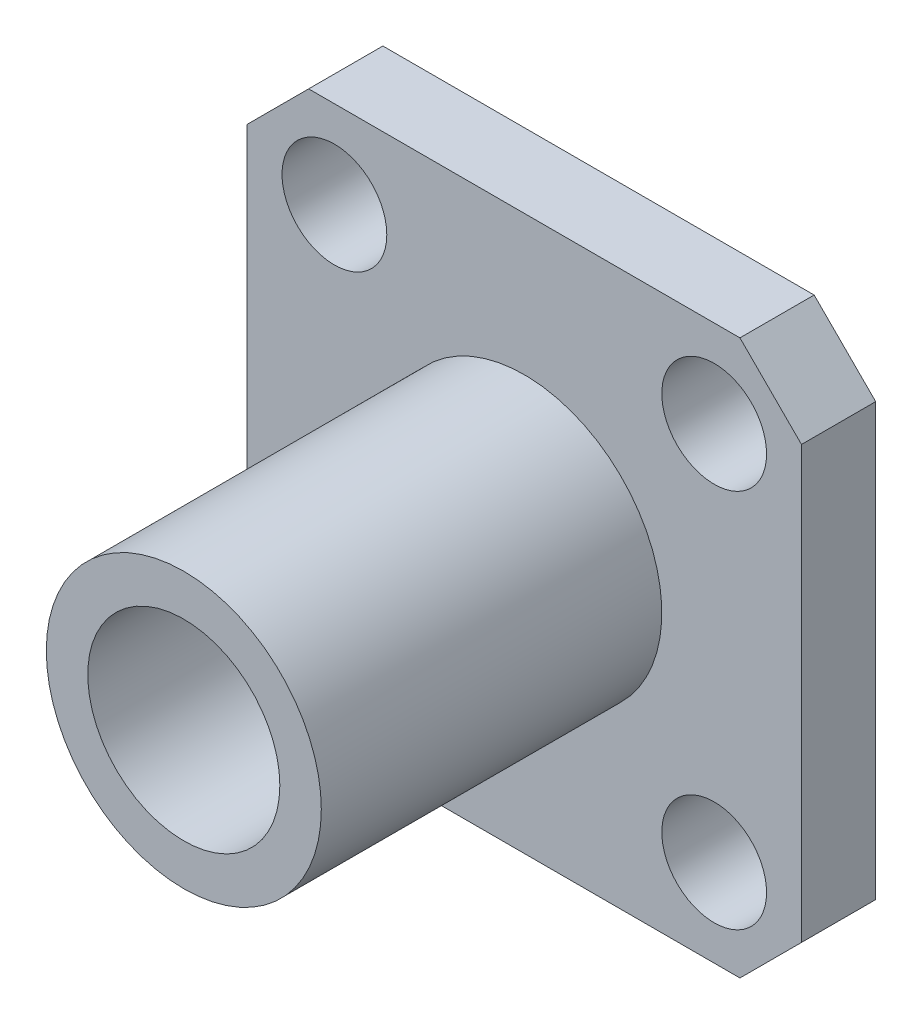
ISO-10303-21;
HEADER;
FILE_DESCRIPTION(('STEP AP214'),'2;1');
FILE_NAME('part.step','',(''),(''),'','','');
FILE_SCHEMA(('AUTOMOTIVE_DESIGN { 1 0 10303 214 1 1 1 1 }'));
ENDSEC;
DATA;
#1=APPLICATION_CONTEXT('core data for automotive mechanical design processes');
#2=APPLICATION_PROTOCOL_DEFINITION('international standard','automotive_design',2000,#1);
#3=PRODUCT_CONTEXT('',#1,'mechanical');
#4=PRODUCT('Part','Part','',(#3));
#5=PRODUCT_RELATED_PRODUCT_CATEGORY('part','',(#4));
#6=PRODUCT_DEFINITION_FORMATION('','',#4);
#7=PRODUCT_DEFINITION_CONTEXT('part definition',#1,'design');
#8=PRODUCT_DEFINITION('design','',#6,#7);
#9=PRODUCT_DEFINITION_SHAPE('','',#8);
#10=(LENGTH_UNIT() NAMED_UNIT(*) SI_UNIT(.MILLI.,.METRE.));
#11=(NAMED_UNIT(*) PLANE_ANGLE_UNIT() SI_UNIT($,.RADIAN.));
#12=(NAMED_UNIT(*) SI_UNIT($,.STERADIAN.) SOLID_ANGLE_UNIT());
#13=UNCERTAINTY_MEASURE_WITH_UNIT(LENGTH_MEASURE(1.E-05),#10,'distance_accuracy_value','');
#14=(GEOMETRIC_REPRESENTATION_CONTEXT(3) GLOBAL_UNCERTAINTY_ASSIGNED_CONTEXT((#13)) GLOBAL_UNIT_ASSIGNED_CONTEXT((#10,
#11,#12)) REPRESENTATION_CONTEXT('',''));
#15=CARTESIAN_POINT('',(0.,0.,0.));
#16=DIRECTION('',(0.,0.,1.));
#17=DIRECTION('',(1.,0.,0.));
#18=AXIS2_PLACEMENT_3D('',#15,#16,#17);
#19=CARTESIAN_POINT('',(6.35,6.35,1.7));
#20=DIRECTION('',(0.,-1.,0.));
#21=DIRECTION('',(0.,0.,-1.));
#22=AXIS2_PLACEMENT_3D('',#19,#20,#21);
#23=PLANE('',#22);
#24=DIRECTION('',(-1.,0.,0.));
#25=VECTOR('',#24,1.);
#26=CARTESIAN_POINT('',(6.35,6.35,0.));
#27=LINE('',#26,#25);
#28=CARTESIAN_POINT('',(4.94,6.35,0.));
#29=VERTEX_POINT('',#28);
#30=CARTESIAN_POINT('',(-4.93999999999999,6.35,0.));
#31=VERTEX_POINT('',#30);
#32=EDGE_CURVE('E164',#29,#31,#27,.T.);
#33=ORIENTED_EDGE('',*,*,#32,.T.);
#34=DIRECTION('',(0.,0.,1.));
#35=VECTOR('',#34,1.);
#36=CARTESIAN_POINT('',(-4.93999999999999,6.35,1.7));
#37=LINE('',#36,#35);
#38=CARTESIAN_POINT('',(-4.93999999999999,6.35,1.7));
#39=VERTEX_POINT('',#38);
#40=EDGE_CURVE('E139',#31,#39,#37,.T.);
#41=ORIENTED_EDGE('',*,*,#40,.T.);
#42=DIRECTION('',(-1.,0.,0.));
#43=VECTOR('',#42,1.);
#44=CARTESIAN_POINT('',(6.35,6.35,1.7));
#45=LINE('',#44,#43);
#46=CARTESIAN_POINT('',(4.94,6.35,1.7));
#47=VERTEX_POINT('',#46);
#48=EDGE_CURVE('E177',#47,#39,#45,.T.);
#49=ORIENTED_EDGE('',*,*,#48,.F.);
#50=DIRECTION('',(0.,0.,-1.));
#51=VECTOR('',#50,1.);
#52=CARTESIAN_POINT('',(4.94,6.35,1.7));
#53=LINE('',#52,#51);
#54=EDGE_CURVE('E145',#47,#29,#53,.T.);
#55=ORIENTED_EDGE('',*,*,#54,.T.);
#56=EDGE_LOOP('',(#33,#41,#49,#55));
#57=FACE_BOUND('',#56,.T.);
#58=ADVANCED_FACE('F65',(#57),#23,.F.);
#59=CARTESIAN_POINT('',(-6.35,-6.35,1.7));
#60=DIRECTION('',(1.,0.,0.));
#61=DIRECTION('',(0.,0.,-1.));
#62=AXIS2_PLACEMENT_3D('',#59,#60,#61);
#63=PLANE('',#62);
#64=DIRECTION('',(0.,-1.,0.));
#65=VECTOR('',#64,1.);
#66=CARTESIAN_POINT('',(-6.35,-6.35,1.7));
#67=LINE('',#66,#65);
#68=CARTESIAN_POINT('',(-6.35,4.93999999999999,1.7));
#69=VERTEX_POINT('',#68);
#70=CARTESIAN_POINT('',(-6.35,-4.94,1.7));
#71=VERTEX_POINT('',#70);
#72=EDGE_CURVE('E155',#69,#71,#67,.T.);
#73=ORIENTED_EDGE('',*,*,#72,.F.);
#74=DIRECTION('',(0.,0.,-1.));
#75=VECTOR('',#74,1.);
#76=CARTESIAN_POINT('',(-6.35,4.93999999999999,1.7));
#77=LINE('',#76,#75);
#78=CARTESIAN_POINT('',(-6.35,4.93999999999999,0.));
#79=VERTEX_POINT('',#78);
#80=EDGE_CURVE('E138',#69,#79,#77,.T.);
#81=ORIENTED_EDGE('',*,*,#80,.T.);
#82=DIRECTION('',(0.,-1.,0.));
#83=VECTOR('',#82,1.);
#84=CARTESIAN_POINT('',(-6.35,-6.35,0.));
#85=LINE('',#84,#83);
#86=CARTESIAN_POINT('',(-6.35,-4.94,0.));
#87=VERTEX_POINT('',#86);
#88=EDGE_CURVE('E152',#79,#87,#85,.T.);
#89=ORIENTED_EDGE('',*,*,#88,.T.);
#90=DIRECTION('',(0.,0.,1.));
#91=VECTOR('',#90,1.);
#92=CARTESIAN_POINT('',(-6.35,-4.94,1.7));
#93=LINE('',#92,#91);
#94=EDGE_CURVE('E158',#87,#71,#93,.T.);
#95=ORIENTED_EDGE('',*,*,#94,.T.);
#96=EDGE_LOOP('',(#73,#81,#89,#95));
#97=FACE_BOUND('',#96,.T.);
#98=ADVANCED_FACE('F151',(#97),#63,.F.);
#99=CARTESIAN_POINT('',(6.35,-6.35,1.7));
#100=DIRECTION('',(0.,1.,0.));
#101=DIRECTION('',(0.,0.,1.));
#102=AXIS2_PLACEMENT_3D('',#99,#100,#101);
#103=PLANE('',#102);
#104=DIRECTION('',(1.,0.,0.));
#105=VECTOR('',#104,1.);
#106=CARTESIAN_POINT('',(6.35,-6.35,0.));
#107=LINE('',#106,#105);
#108=CARTESIAN_POINT('',(-4.93999999999999,-6.35,0.));
#109=VERTEX_POINT('',#108);
#110=CARTESIAN_POINT('',(4.94,-6.35,0.));
#111=VERTEX_POINT('',#110);
#112=EDGE_CURVE('E163',#109,#111,#107,.T.);
#113=ORIENTED_EDGE('',*,*,#112,.T.);
#114=DIRECTION('',(0.,0.,1.));
#115=VECTOR('',#114,1.);
#116=CARTESIAN_POINT('',(4.94,-6.35,1.7));
#117=LINE('',#116,#115);
#118=CARTESIAN_POINT('',(4.94,-6.35,1.7));
#119=VERTEX_POINT('',#118);
#120=EDGE_CURVE('E75',#111,#119,#117,.T.);
#121=ORIENTED_EDGE('',*,*,#120,.T.);
#122=DIRECTION('',(1.,0.,0.));
#123=VECTOR('',#122,1.);
#124=CARTESIAN_POINT('',(6.35,-6.35,1.7));
#125=LINE('',#124,#123);
#126=CARTESIAN_POINT('',(-4.93999999999999,-6.35,1.7));
#127=VERTEX_POINT('',#126);
#128=EDGE_CURVE('E218',#127,#119,#125,.T.);
#129=ORIENTED_EDGE('',*,*,#128,.F.);
#130=DIRECTION('',(0.,0.,-1.));
#131=VECTOR('',#130,1.);
#132=CARTESIAN_POINT('',(-4.93999999999999,-6.35,1.7));
#133=LINE('',#132,#131);
#134=EDGE_CURVE('E210',#127,#109,#133,.T.);
#135=ORIENTED_EDGE('',*,*,#134,.T.);
#136=EDGE_LOOP('',(#113,#121,#129,#135));
#137=FACE_BOUND('',#136,.T.);
#138=ADVANCED_FACE('F217',(#137),#103,.F.);
#139=CARTESIAN_POINT('',(6.35,-6.35,1.7));
#140=DIRECTION('',(-1.,0.,0.));
#141=DIRECTION('',(0.,0.,1.));
#142=AXIS2_PLACEMENT_3D('',#139,#140,#141);
#143=PLANE('',#142);
#144=DIRECTION('',(0.,1.,0.));
#145=VECTOR('',#144,1.);
#146=CARTESIAN_POINT('',(6.35,-6.35,0.));
#147=LINE('',#146,#145);
#148=CARTESIAN_POINT('',(6.35,-4.94,0.));
#149=VERTEX_POINT('',#148);
#150=CARTESIAN_POINT('',(6.35,4.93999999999999,0.));
#151=VERTEX_POINT('',#150);
#152=EDGE_CURVE('E169',#149,#151,#147,.T.);
#153=ORIENTED_EDGE('',*,*,#152,.T.);
#154=DIRECTION('',(0.,0.,1.));
#155=VECTOR('',#154,1.);
#156=CARTESIAN_POINT('',(6.35,4.93999999999999,1.7));
#157=LINE('',#156,#155);
#158=CARTESIAN_POINT('',(6.35,4.93999999999999,1.7));
#159=VERTEX_POINT('',#158);
#160=EDGE_CURVE('E82',#151,#159,#157,.T.);
#161=ORIENTED_EDGE('',*,*,#160,.T.);
#162=DIRECTION('',(0.,1.,0.));
#163=VECTOR('',#162,1.);
#164=CARTESIAN_POINT('',(6.35,-6.35,1.7));
#165=LINE('',#164,#163);
#166=CARTESIAN_POINT('',(6.35,-4.94,1.7));
#167=VERTEX_POINT('',#166);
#168=EDGE_CURVE('E179',#167,#159,#165,.T.);
#169=ORIENTED_EDGE('',*,*,#168,.F.);
#170=DIRECTION('',(0.,0.,-1.));
#171=VECTOR('',#170,1.);
#172=CARTESIAN_POINT('',(6.35,-4.94,1.7));
#173=LINE('',#172,#171);
#174=EDGE_CURVE('E204',#167,#149,#173,.T.);
#175=ORIENTED_EDGE('',*,*,#174,.T.);
#176=EDGE_LOOP('',(#153,#161,#169,#175));
#177=FACE_BOUND('',#176,.T.);
#178=ADVANCED_FACE('F229',(#177),#143,.F.);
#179=CARTESIAN_POINT('',(0.,0.,1.7));
#180=DIRECTION('',(0.,0.,-1.));
#181=DIRECTION('',(-1.,0.,0.));
#182=AXIS2_PLACEMENT_3D('',#179,#180,#181);
#183=PLANE('',#182);
#184=CARTESIAN_POINT('',(0.,0.,1.7));
#185=DIRECTION('',(0.,0.,-1.));
#186=DIRECTION('',(-1.,0.,0.));
#187=AXIS2_PLACEMENT_3D('',#184,#185,#186);
#188=CIRCLE('',#187,3.15);
#189=CARTESIAN_POINT('',(-3.15,0.,1.7));
#190=VERTEX_POINT('',#189);
#191=EDGE_CURVE('E14',#190,#190,#188,.F.);
#192=ORIENTED_EDGE('',*,*,#191,.F.);
#193=EDGE_LOOP('',(#192));
#194=FACE_BOUND('',#193,.T.);
#195=CARTESIAN_POINT('',(-4.35,4.35,1.7));
#196=DIRECTION('',(0.,0.,1.));
#197=DIRECTION('',(1.,0.,0.));
#198=AXIS2_PLACEMENT_3D('',#195,#196,#197);
#199=CIRCLE('',#198,1.2);
#200=CARTESIAN_POINT('',(-3.15,4.35,1.7));
#201=VERTEX_POINT('',#200);
#202=EDGE_CURVE('E254',#201,#201,#199,.T.);
#203=ORIENTED_EDGE('',*,*,#202,.F.);
#204=EDGE_LOOP('',(#203));
#205=FACE_BOUND('',#204,.T.);
#206=CARTESIAN_POINT('',(-4.35,-4.35,1.7));
#207=DIRECTION('',(0.,0.,1.));
#208=DIRECTION('',(1.,0.,0.));
#209=AXIS2_PLACEMENT_3D('',#206,#207,#208);
#210=CIRCLE('',#209,1.2);
#211=CARTESIAN_POINT('',(-3.15,-4.35,1.7));
#212=VERTEX_POINT('',#211);
#213=EDGE_CURVE('E263',#212,#212,#210,.T.);
#214=ORIENTED_EDGE('',*,*,#213,.F.);
#215=EDGE_LOOP('',(#214));
#216=FACE_BOUND('',#215,.T.);
#217=CARTESIAN_POINT('',(4.35,-4.35,1.7));
#218=DIRECTION('',(0.,0.,1.));
#219=DIRECTION('',(1.,0.,0.));
#220=AXIS2_PLACEMENT_3D('',#217,#218,#219);
#221=CIRCLE('',#220,1.2);
#222=CARTESIAN_POINT('',(5.55,-4.35,1.7));
#223=VERTEX_POINT('',#222);
#224=EDGE_CURVE('E246',#223,#223,#221,.T.);
#225=ORIENTED_EDGE('',*,*,#224,.F.);
#226=EDGE_LOOP('',(#225));
#227=FACE_BOUND('',#226,.T.);
#228=CARTESIAN_POINT('',(4.35,4.35,1.7));
#229=DIRECTION('',(0.,0.,1.));
#230=DIRECTION('',(1.,0.,0.));
#231=AXIS2_PLACEMENT_3D('',#228,#229,#230);
#232=CIRCLE('',#231,1.2);
#233=CARTESIAN_POINT('',(5.55,4.35,1.7));
#234=VERTEX_POINT('',#233);
#235=EDGE_CURVE('E241',#234,#234,#232,.T.);
#236=ORIENTED_EDGE('',*,*,#235,.F.);
#237=EDGE_LOOP('',(#236));
#238=FACE_BOUND('',#237,.T.);
#239=ORIENTED_EDGE('',*,*,#48,.T.);
#240=DIRECTION('',(0.707106781186548,0.707106781186548,0.));
#241=VECTOR('',#240,1.);
#242=CARTESIAN_POINT('',(-6.35,4.93999999999999,1.7));
#243=LINE('',#242,#241);
#244=EDGE_CURVE('E201',#39,#69,#243,.F.);
#245=ORIENTED_EDGE('',*,*,#244,.T.);
#246=ORIENTED_EDGE('',*,*,#72,.T.);
#247=DIRECTION('',(-0.707106781186548,0.707106781186548,0.));
#248=VECTOR('',#247,1.);
#249=CARTESIAN_POINT('',(-4.93999999999999,-6.35,1.7));
#250=LINE('',#249,#248);
#251=EDGE_CURVE('E193',#71,#127,#250,.F.);
#252=ORIENTED_EDGE('',*,*,#251,.T.);
#253=ORIENTED_EDGE('',*,*,#128,.T.);
#254=DIRECTION('',(-0.707106781186548,-0.707106781186548,0.));
#255=VECTOR('',#254,1.);
#256=CARTESIAN_POINT('',(6.35,-4.94,1.7));
#257=LINE('',#256,#255);
#258=EDGE_CURVE('E89',#119,#167,#257,.F.);
#259=ORIENTED_EDGE('',*,*,#258,.T.);
#260=ORIENTED_EDGE('',*,*,#168,.T.);
#261=DIRECTION('',(0.707106781186548,-0.707106781186548,0.));
#262=VECTOR('',#261,1.);
#263=CARTESIAN_POINT('',(4.94,6.35,1.7));
#264=LINE('',#263,#262);
#265=EDGE_CURVE('E198',#159,#47,#264,.F.);
#266=ORIENTED_EDGE('',*,*,#265,.T.);
#267=EDGE_LOOP('',(#239,#245,#246,#252,#253,#259,#260,#266));
#268=FACE_BOUND('',#267,.T.);
#269=ADVANCED_FACE('F222',(#194,#205,#216,#227,#238,#268),#183,.F.);
#270=CARTESIAN_POINT('',(0.,0.,0.));
#271=DIRECTION('',(0.,0.,-1.));
#272=DIRECTION('',(-1.,0.,0.));
#273=AXIS2_PLACEMENT_3D('',#270,#271,#272);
#274=PLANE('',#273);
#275=CARTESIAN_POINT('',(0.,0.,0.));
#276=DIRECTION('',(0.,0.,-1.));
#277=DIRECTION('',(-1.,0.,0.));
#278=AXIS2_PLACEMENT_3D('',#275,#276,#277);
#279=CIRCLE('',#278,0.64);
#280=CARTESIAN_POINT('',(-0.64,0.,0.));
#281=VERTEX_POINT('',#280);
#282=EDGE_CURVE('E286',#281,#281,#279,.T.);
#283=ORIENTED_EDGE('',*,*,#282,.F.);
#284=EDGE_LOOP('',(#283));
#285=FACE_BOUND('',#284,.T.);
#286=CARTESIAN_POINT('',(-4.35,4.35,0.));
#287=DIRECTION('',(0.,0.,1.));
#288=DIRECTION('',(1.,0.,0.));
#289=AXIS2_PLACEMENT_3D('',#286,#287,#288);
#290=CIRCLE('',#289,1.2);
#291=CARTESIAN_POINT('',(-3.15,4.35,0.));
#292=VERTEX_POINT('',#291);
#293=EDGE_CURVE('E250',#292,#292,#290,.T.);
#294=ORIENTED_EDGE('',*,*,#293,.T.);
#295=EDGE_LOOP('',(#294));
#296=FACE_BOUND('',#295,.T.);
#297=CARTESIAN_POINT('',(-4.35,-4.35,0.));
#298=DIRECTION('',(0.,0.,1.));
#299=DIRECTION('',(1.,0.,0.));
#300=AXIS2_PLACEMENT_3D('',#297,#298,#299);
#301=CIRCLE('',#300,1.2);
#302=CARTESIAN_POINT('',(-3.15,-4.35,0.));
#303=VERTEX_POINT('',#302);
#304=EDGE_CURVE('E259',#303,#303,#301,.T.);
#305=ORIENTED_EDGE('',*,*,#304,.T.);
#306=EDGE_LOOP('',(#305));
#307=FACE_BOUND('',#306,.T.);
#308=CARTESIAN_POINT('',(4.35,-4.35,0.));
#309=DIRECTION('',(0.,0.,1.));
#310=DIRECTION('',(1.,0.,0.));
#311=AXIS2_PLACEMENT_3D('',#308,#309,#310);
#312=CIRCLE('',#311,1.2);
#313=CARTESIAN_POINT('',(5.55,-4.35,0.));
#314=VERTEX_POINT('',#313);
#315=EDGE_CURVE('E267',#314,#314,#312,.T.);
#316=ORIENTED_EDGE('',*,*,#315,.T.);
#317=EDGE_LOOP('',(#316));
#318=FACE_BOUND('',#317,.T.);
#319=CARTESIAN_POINT('',(4.35,4.35,0.));
#320=DIRECTION('',(0.,0.,1.));
#321=DIRECTION('',(1.,0.,0.));
#322=AXIS2_PLACEMENT_3D('',#319,#320,#321);
#323=CIRCLE('',#322,1.2);
#324=CARTESIAN_POINT('',(5.55,4.35,0.));
#325=VERTEX_POINT('',#324);
#326=EDGE_CURVE('E171',#325,#325,#323,.T.);
#327=ORIENTED_EDGE('',*,*,#326,.T.);
#328=EDGE_LOOP('',(#327));
#329=FACE_BOUND('',#328,.T.);
#330=ORIENTED_EDGE('',*,*,#88,.F.);
#331=DIRECTION('',(-0.707106781186548,-0.707106781186548,0.));
#332=VECTOR('',#331,1.);
#333=CARTESIAN_POINT('',(-5.645,5.645,0.));
#334=LINE('',#333,#332);
#335=EDGE_CURVE('E134',#79,#31,#334,.F.);
#336=ORIENTED_EDGE('',*,*,#335,.T.);
#337=ORIENTED_EDGE('',*,*,#32,.F.);
#338=DIRECTION('',(-0.707106781186548,0.707106781186548,0.));
#339=VECTOR('',#338,1.);
#340=CARTESIAN_POINT('',(5.645,5.645,0.));
#341=LINE('',#340,#339);
#342=EDGE_CURVE('E146',#29,#151,#341,.F.);
#343=ORIENTED_EDGE('',*,*,#342,.T.);
#344=ORIENTED_EDGE('',*,*,#152,.F.);
#345=DIRECTION('',(0.707106781186548,0.707106781186548,0.));
#346=VECTOR('',#345,1.);
#347=CARTESIAN_POINT('',(5.645,-5.645,0.));
#348=LINE('',#347,#346);
#349=EDGE_CURVE('E183',#149,#111,#348,.F.);
#350=ORIENTED_EDGE('',*,*,#349,.T.);
#351=ORIENTED_EDGE('',*,*,#112,.F.);
#352=DIRECTION('',(0.707106781186548,-0.707106781186548,0.));
#353=VECTOR('',#352,1.);
#354=CARTESIAN_POINT('',(-5.645,-5.645,0.));
#355=LINE('',#354,#353);
#356=EDGE_CURVE('E157',#109,#87,#355,.F.);
#357=ORIENTED_EDGE('',*,*,#356,.T.);
#358=EDGE_LOOP('',(#330,#336,#337,#343,#344,#350,#351,#357));
#359=FACE_BOUND('',#358,.T.);
#360=ADVANCED_FACE('F160',(#285,#296,#307,#318,#329,#359),#274,.T.);
#361=CARTESIAN_POINT('',(-6.35,4.93999999999999,1.7));
#362=DIRECTION('',(0.707106781186547,-0.707106781186547,0.));
#363=DIRECTION('',(0.,0.,-1.));
#364=AXIS2_PLACEMENT_3D('',#361,#362,#363);
#365=PLANE('',#364);
#366=ORIENTED_EDGE('',*,*,#244,.F.);
#367=ORIENTED_EDGE('',*,*,#40,.F.);
#368=ORIENTED_EDGE('',*,*,#335,.F.);
#369=ORIENTED_EDGE('',*,*,#80,.F.);
#370=EDGE_LOOP('',(#366,#367,#368,#369));
#371=FACE_BOUND('',#370,.T.);
#372=ADVANCED_FACE('F137',(#371),#365,.F.);
#373=CARTESIAN_POINT('',(4.94,6.35,1.7));
#374=DIRECTION('',(-0.707106781186547,-0.707106781186547,0.));
#375=DIRECTION('',(0.,0.,-1.));
#376=AXIS2_PLACEMENT_3D('',#373,#374,#375);
#377=PLANE('',#376);
#378=ORIENTED_EDGE('',*,*,#265,.F.);
#379=ORIENTED_EDGE('',*,*,#160,.F.);
#380=ORIENTED_EDGE('',*,*,#342,.F.);
#381=ORIENTED_EDGE('',*,*,#54,.F.);
#382=EDGE_LOOP('',(#378,#379,#380,#381));
#383=FACE_BOUND('',#382,.T.);
#384=ADVANCED_FACE('F233',(#383),#377,.F.);
#385=CARTESIAN_POINT('',(6.35,-4.94,1.7));
#386=DIRECTION('',(-0.707106781186547,0.707106781186547,0.));
#387=DIRECTION('',(0.,0.,-1.));
#388=AXIS2_PLACEMENT_3D('',#385,#386,#387);
#389=PLANE('',#388);
#390=ORIENTED_EDGE('',*,*,#258,.F.);
#391=ORIENTED_EDGE('',*,*,#120,.F.);
#392=ORIENTED_EDGE('',*,*,#349,.F.);
#393=ORIENTED_EDGE('',*,*,#174,.F.);
#394=EDGE_LOOP('',(#390,#391,#392,#393));
#395=FACE_BOUND('',#394,.T.);
#396=ADVANCED_FACE('F227',(#395),#389,.F.);
#397=CARTESIAN_POINT('',(-4.93999999999999,-6.35,1.7));
#398=DIRECTION('',(0.707106781186547,0.707106781186547,0.));
#399=DIRECTION('',(0.,0.,-1.));
#400=AXIS2_PLACEMENT_3D('',#397,#398,#399);
#401=PLANE('',#400);
#402=ORIENTED_EDGE('',*,*,#251,.F.);
#403=ORIENTED_EDGE('',*,*,#94,.F.);
#404=ORIENTED_EDGE('',*,*,#356,.F.);
#405=ORIENTED_EDGE('',*,*,#134,.F.);
#406=EDGE_LOOP('',(#402,#403,#404,#405));
#407=FACE_BOUND('',#406,.T.);
#408=ADVANCED_FACE('F68',(#407),#401,.F.);
#409=CARTESIAN_POINT('',(4.35,4.35,0.));
#410=DIRECTION('',(0.,0.,1.));
#411=DIRECTION('',(1.,0.,0.));
#412=AXIS2_PLACEMENT_3D('',#409,#410,#411);
#413=CYLINDRICAL_SURFACE('',#412,1.2);
#414=ORIENTED_EDGE('',*,*,#326,.F.);
#415=EDGE_LOOP('',(#414));
#416=FACE_BOUND('',#415,.T.);
#417=ORIENTED_EDGE('',*,*,#235,.T.);
#418=EDGE_LOOP('',(#417));
#419=FACE_BOUND('',#418,.T.);
#420=ADVANCED_FACE('F314',(#416,#419),#413,.F.);
#421=CARTESIAN_POINT('',(4.35,-4.35,0.));
#422=DIRECTION('',(0.,0.,1.));
#423=DIRECTION('',(1.,0.,0.));
#424=AXIS2_PLACEMENT_3D('',#421,#422,#423);
#425=CYLINDRICAL_SURFACE('',#424,1.2);
#426=ORIENTED_EDGE('',*,*,#315,.F.);
#427=EDGE_LOOP('',(#426));
#428=FACE_BOUND('',#427,.T.);
#429=ORIENTED_EDGE('',*,*,#224,.T.);
#430=EDGE_LOOP('',(#429));
#431=FACE_BOUND('',#430,.T.);
#432=ADVANCED_FACE('F317',(#428,#431),#425,.F.);
#433=CARTESIAN_POINT('',(-4.35,-4.35,0.));
#434=DIRECTION('',(0.,0.,1.));
#435=DIRECTION('',(1.,0.,0.));
#436=AXIS2_PLACEMENT_3D('',#433,#434,#435);
#437=CYLINDRICAL_SURFACE('',#436,1.2);
#438=ORIENTED_EDGE('',*,*,#304,.F.);
#439=EDGE_LOOP('',(#438));
#440=FACE_BOUND('',#439,.T.);
#441=ORIENTED_EDGE('',*,*,#213,.T.);
#442=EDGE_LOOP('',(#441));
#443=FACE_BOUND('',#442,.T.);
#444=ADVANCED_FACE('F374',(#440,#443),#437,.F.);
#445=CARTESIAN_POINT('',(-4.35,4.35,0.));
#446=DIRECTION('',(0.,0.,1.));
#447=DIRECTION('',(1.,0.,0.));
#448=AXIS2_PLACEMENT_3D('',#445,#446,#447);
#449=CYLINDRICAL_SURFACE('',#448,1.2);
#450=ORIENTED_EDGE('',*,*,#293,.F.);
#451=EDGE_LOOP('',(#450));
#452=FACE_BOUND('',#451,.T.);
#453=ORIENTED_EDGE('',*,*,#202,.T.);
#454=EDGE_LOOP('',(#453));
#455=FACE_BOUND('',#454,.T.);
#456=ADVANCED_FACE('F382',(#452,#455),#449,.F.);
#457=CARTESIAN_POINT('',(0.,0.,9.5));
#458=DIRECTION('',(0.,0.,1.));
#459=DIRECTION('',(1.,0.,0.));
#460=AXIS2_PLACEMENT_3D('',#457,#458,#459);
#461=PLANE('',#460);
#462=CARTESIAN_POINT('',(0.,0.,9.5));
#463=DIRECTION('',(0.,0.,1.));
#464=DIRECTION('',(1.,0.,0.));
#465=AXIS2_PLACEMENT_3D('',#462,#463,#464);
#466=CIRCLE('',#465,3.15);
#467=CARTESIAN_POINT('',(3.15,0.,9.5));
#468=VERTEX_POINT('',#467);
#469=EDGE_CURVE('E255',#468,#468,#466,.T.);
#470=ORIENTED_EDGE('',*,*,#469,.T.);
#471=EDGE_LOOP('',(#470));
#472=FACE_BOUND('',#471,.T.);
#473=CARTESIAN_POINT('',(0.,0.,9.5));
#474=DIRECTION('',(0.,0.,1.));
#475=DIRECTION('',(1.,0.,0.));
#476=AXIS2_PLACEMENT_3D('',#473,#474,#475);
#477=CIRCLE('',#476,2.2);
#478=CARTESIAN_POINT('',(2.2,0.,9.5));
#479=VERTEX_POINT('',#478);
#480=EDGE_CURVE('E277',#479,#479,#477,.T.);
#481=ORIENTED_EDGE('',*,*,#480,.F.);
#482=EDGE_LOOP('',(#481));
#483=FACE_BOUND('',#482,.T.);
#484=ADVANCED_FACE('F390',(#472,#483),#461,.T.);
#485=CARTESIAN_POINT('',(0.,0.,9.5));
#486=DIRECTION('',(0.,0.,-1.));
#487=DIRECTION('',(-1.,0.,0.));
#488=AXIS2_PLACEMENT_3D('',#485,#486,#487);
#489=CYLINDRICAL_SURFACE('',#488,3.15);
#490=ORIENTED_EDGE('',*,*,#469,.F.);
#491=EDGE_LOOP('',(#490));
#492=FACE_BOUND('',#491,.T.);
#493=ORIENTED_EDGE('',*,*,#191,.T.);
#494=EDGE_LOOP('',(#493));
#495=FACE_BOUND('',#494,.T.);
#496=ADVANCED_FACE('F407',(#492,#495),#489,.T.);
#497=CARTESIAN_POINT('',(0.,0.,9.5));
#498=DIRECTION('',(0.,0.,-1.));
#499=DIRECTION('',(-1.,0.,0.));
#500=AXIS2_PLACEMENT_3D('',#497,#498,#499);
#501=CYLINDRICAL_SURFACE('',#500,2.2);
#502=ORIENTED_EDGE('',*,*,#480,.T.);
#503=EDGE_LOOP('',(#502));
#504=FACE_BOUND('',#503,.T.);
#505=CARTESIAN_POINT('',(0.,0.,1.7));
#506=DIRECTION('',(0.,0.,1.));
#507=DIRECTION('',(1.,0.,0.));
#508=AXIS2_PLACEMENT_3D('',#505,#506,#507);
#509=CIRCLE('',#508,2.2);
#510=CARTESIAN_POINT('',(2.2,0.,1.7));
#511=VERTEX_POINT('',#510);
#512=EDGE_CURVE('E278',#511,#511,#509,.T.);
#513=ORIENTED_EDGE('',*,*,#512,.F.);
#514=EDGE_LOOP('',(#513));
#515=FACE_BOUND('',#514,.T.);
#516=ADVANCED_FACE('F333',(#504,#515),#501,.F.);
#517=ORIENTED_EDGE('',*,*,#512,.T.);
#518=EDGE_LOOP('',(#517));
#519=FACE_BOUND('',#518,.T.);
#520=ADVANCED_FACE('F299',(#519),#183,.F.);
#521=CARTESIAN_POINT('',(0.,0.,-5.));
#522=DIRECTION('',(0.,0.,1.));
#523=DIRECTION('',(1.,0.,0.));
#524=AXIS2_PLACEMENT_3D('',#521,#522,#523);
#525=CYLINDRICAL_SURFACE('',#524,0.64);
#526=CARTESIAN_POINT('',(0.,0.,-5.));
#527=DIRECTION('',(0.,0.,-1.));
#528=DIRECTION('',(-1.,0.,0.));
#529=AXIS2_PLACEMENT_3D('',#526,#527,#528);
#530=CIRCLE('',#529,0.64);
#531=CARTESIAN_POINT('',(-0.64,0.,-5.));
#532=VERTEX_POINT('',#531);
#533=EDGE_CURVE('E282',#532,#532,#530,.T.);
#534=ORIENTED_EDGE('',*,*,#533,.F.);
#535=EDGE_LOOP('',(#534));
#536=FACE_BOUND('',#535,.T.);
#537=ORIENTED_EDGE('',*,*,#282,.T.);
#538=EDGE_LOOP('',(#537));
#539=FACE_BOUND('',#538,.T.);
#540=ADVANCED_FACE('F296',(#536,#539),#525,.T.);
#541=CARTESIAN_POINT('',(0.,0.,-5.));
#542=DIRECTION('',(0.,0.,-1.));
#543=DIRECTION('',(-1.,0.,0.));
#544=AXIS2_PLACEMENT_3D('',#541,#542,#543);
#545=PLANE('',#544);
#546=ORIENTED_EDGE('',*,*,#533,.T.);
#547=EDGE_LOOP('',(#546));
#548=FACE_BOUND('',#547,.T.);
#549=ADVANCED_FACE('F294',(#548),#545,.T.);
#550=CLOSED_SHELL('',(#58,#98,#138,#178,#269,#360,#372,#384,#396,#408,#420,#432,#444,#456,#484,
#496,#516,#520,#540,#549));
#551=MANIFOLD_SOLID_BREP('B2',#550);
#552=ADVANCED_BREP_SHAPE_REPRESENTATION('',(#18,#551),#14);
#553=SHAPE_DEFINITION_REPRESENTATION(#9,#552);
ENDSEC;
END-ISO-10303-21;
